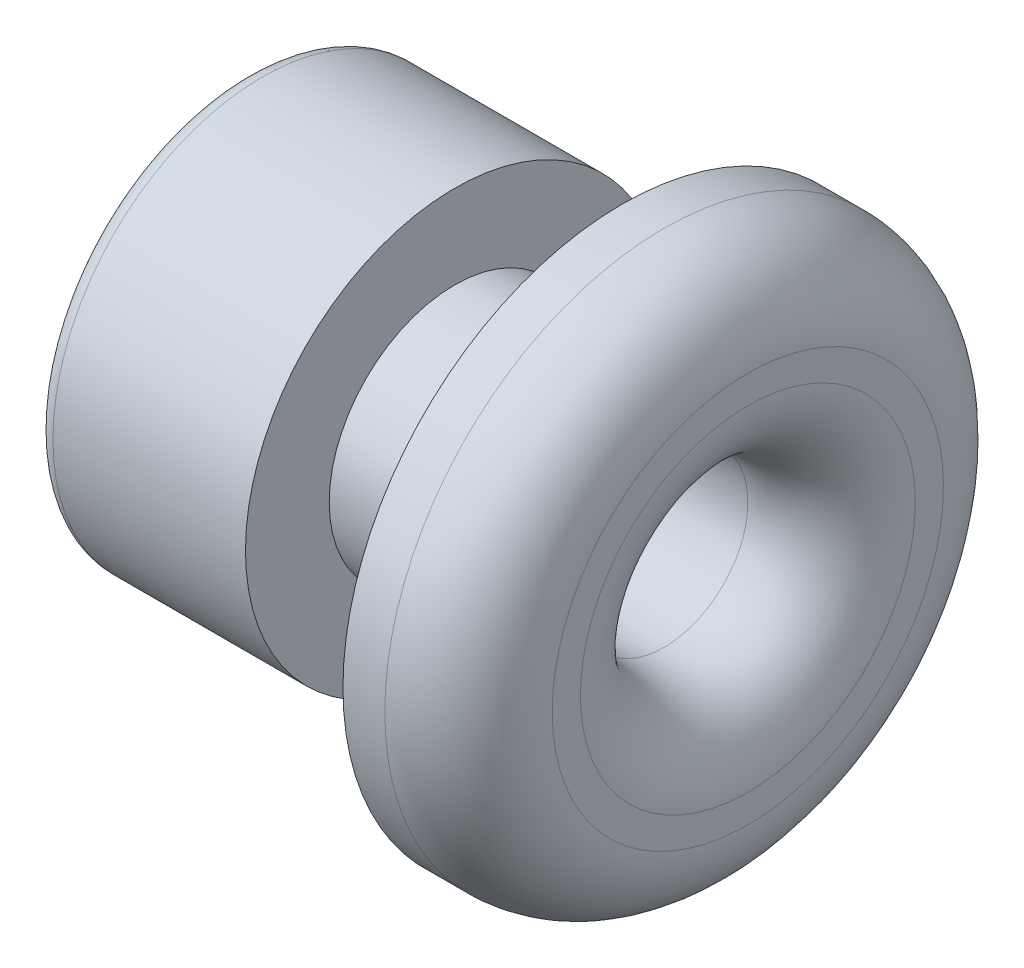
ISO-10303-21;
HEADER;
FILE_DESCRIPTION(('STEP AP214'),'2;1');
FILE_NAME('part.step','',(''),(''),'','','');
FILE_SCHEMA(('AUTOMOTIVE_DESIGN { 1 0 10303 214 1 1 1 1 }'));
ENDSEC;
DATA;
#1=APPLICATION_CONTEXT('core data for automotive mechanical design processes');
#2=APPLICATION_PROTOCOL_DEFINITION('international standard','automotive_design',2000,#1);
#3=PRODUCT_CONTEXT('',#1,'mechanical');
#4=PRODUCT('Part','Part','',(#3));
#5=PRODUCT_RELATED_PRODUCT_CATEGORY('part','',(#4));
#6=PRODUCT_DEFINITION_FORMATION('','',#4);
#7=PRODUCT_DEFINITION_CONTEXT('part definition',#1,'design');
#8=PRODUCT_DEFINITION('design','',#6,#7);
#9=PRODUCT_DEFINITION_SHAPE('','',#8);
#10=(LENGTH_UNIT() NAMED_UNIT(*) SI_UNIT(.MILLI.,.METRE.));
#11=(NAMED_UNIT(*) PLANE_ANGLE_UNIT() SI_UNIT($,.RADIAN.));
#12=(NAMED_UNIT(*) SI_UNIT($,.STERADIAN.) SOLID_ANGLE_UNIT());
#13=UNCERTAINTY_MEASURE_WITH_UNIT(LENGTH_MEASURE(1.E-05),#10,'distance_accuracy_value','');
#14=(GEOMETRIC_REPRESENTATION_CONTEXT(3) GLOBAL_UNCERTAINTY_ASSIGNED_CONTEXT((#13)) GLOBAL_UNIT_ASSIGNED_CONTEXT((#10,
#11,#12)) REPRESENTATION_CONTEXT('',''));
#15=CARTESIAN_POINT('',(0.,0.,0.));
#16=DIRECTION('',(0.,0.,1.));
#17=DIRECTION('',(1.,0.,0.));
#18=AXIS2_PLACEMENT_3D('',#15,#16,#17);
#19=CARTESIAN_POINT('',(0.,0.,0.));
#20=DIRECTION('',(-1.,0.,0.));
#21=DIRECTION('',(0.,0.,1.));
#22=AXIS2_PLACEMENT_3D('',#19,#20,#21);
#23=CYLINDRICAL_SURFACE('',#22,3.3359852338276);
#24=CARTESIAN_POINT('',(0.0562441814122448,0.,0.));
#25=DIRECTION('',(-1.,0.,0.));
#26=DIRECTION('',(0.,0.,1.));
#27=AXIS2_PLACEMENT_3D('',#24,#25,#26);
#28=CIRCLE('',#27,3.3359852338276);
#29=CARTESIAN_POINT('',(0.0562441814122448,0.,3.3359852338276));
#30=VERTEX_POINT('',#29);
#31=EDGE_CURVE('E10',#30,#30,#28,.T.);
#32=ORIENTED_EDGE('',*,*,#31,.F.);
#33=EDGE_LOOP('',(#32));
#34=FACE_BOUND('',#33,.T.);
#35=CARTESIAN_POINT('',(0.556244181412245,0.,0.));
#36=DIRECTION('',(-1.,0.,0.));
#37=DIRECTION('',(0.,0.,1.));
#38=AXIS2_PLACEMENT_3D('',#35,#36,#37);
#39=CIRCLE('',#38,3.3359852338276);
#40=CARTESIAN_POINT('',(0.556244181412245,0.,3.3359852338276));
#41=VERTEX_POINT('',#40);
#42=EDGE_CURVE('E61',#41,#41,#39,.T.);
#43=ORIENTED_EDGE('',*,*,#42,.T.);
#44=EDGE_LOOP('',(#43));
#45=FACE_BOUND('',#44,.T.);
#46=ADVANCED_FACE('F15',(#34,#45),#23,.T.);
#47=CARTESIAN_POINT('',(0.0562441814122448,3.3359852338276,0.));
#48=DIRECTION('',(1.,0.,0.));
#49=DIRECTION('',(0.,0.,-1.));
#50=AXIS2_PLACEMENT_3D('',#47,#48,#49);
#51=PLANE('',#50);
#52=CARTESIAN_POINT('',(0.0562441814122453,0.,0.));
#53=DIRECTION('',(-1.,0.,0.));
#54=DIRECTION('',(0.,0.,1.));
#55=AXIS2_PLACEMENT_3D('',#52,#53,#54);
#56=CIRCLE('',#55,1.5);
#57=CARTESIAN_POINT('',(0.0562441814122453,0.,1.5));
#58=VERTEX_POINT('',#57);
#59=EDGE_CURVE('E21',#58,#58,#56,.T.);
#60=ORIENTED_EDGE('',*,*,#59,.F.);
#61=EDGE_LOOP('',(#60));
#62=FACE_BOUND('',#61,.T.);
#63=ORIENTED_EDGE('',*,*,#31,.T.);
#64=EDGE_LOOP('',(#63));
#65=FACE_BOUND('',#64,.T.);
#66=ADVANCED_FACE('F134',(#62,#65),#51,.F.);
#67=CARTESIAN_POINT('',(0.,0.,0.));
#68=DIRECTION('',(-1.,0.,0.));
#69=DIRECTION('',(0.,0.,1.));
#70=AXIS2_PLACEMENT_3D('',#67,#68,#69);
#71=CYLINDRICAL_SURFACE('',#70,1.5);
#72=CARTESIAN_POINT('',(-1.94375581858776,0.,0.));
#73=DIRECTION('',(-1.,0.,0.));
#74=DIRECTION('',(0.,0.,1.));
#75=AXIS2_PLACEMENT_3D('',#72,#73,#74);
#76=CIRCLE('',#75,1.5);
#77=CARTESIAN_POINT('',(-1.94375581858776,0.,1.5));
#78=VERTEX_POINT('',#77);
#79=EDGE_CURVE('E25',#78,#78,#76,.T.);
#80=ORIENTED_EDGE('',*,*,#79,.F.);
#81=EDGE_LOOP('',(#80));
#82=FACE_BOUND('',#81,.T.);
#83=ORIENTED_EDGE('',*,*,#59,.T.);
#84=EDGE_LOOP('',(#83));
#85=FACE_BOUND('',#84,.T.);
#86=ADVANCED_FACE('F129',(#82,#85),#71,.T.);
#87=CARTESIAN_POINT('',(-1.94375581858776,1.5,0.));
#88=DIRECTION('',(-1.,0.,0.));
#89=DIRECTION('',(0.,0.,1.));
#90=AXIS2_PLACEMENT_3D('',#87,#88,#89);
#91=PLANE('',#90);
#92=CARTESIAN_POINT('',(-1.94375581858776,0.,0.));
#93=DIRECTION('',(-1.,0.,0.));
#94=DIRECTION('',(0.,0.,1.));
#95=AXIS2_PLACEMENT_3D('',#92,#93,#94);
#96=CIRCLE('',#95,2.5);
#97=CARTESIAN_POINT('',(-1.94375581858776,0.,2.5));
#98=VERTEX_POINT('',#97);
#99=EDGE_CURVE('E29',#98,#98,#96,.T.);
#100=ORIENTED_EDGE('',*,*,#99,.F.);
#101=EDGE_LOOP('',(#100));
#102=FACE_BOUND('',#101,.T.);
#103=ORIENTED_EDGE('',*,*,#79,.T.);
#104=EDGE_LOOP('',(#103));
#105=FACE_BOUND('',#104,.T.);
#106=ADVANCED_FACE('F123',(#102,#105),#91,.F.);
#107=CARTESIAN_POINT('',(0.,0.,0.));
#108=DIRECTION('',(-1.,0.,0.));
#109=DIRECTION('',(0.,0.,1.));
#110=AXIS2_PLACEMENT_3D('',#107,#108,#109);
#111=CYLINDRICAL_SURFACE('',#110,2.5);
#112=CARTESIAN_POINT('',(-4.24375581858776,0.,0.));
#113=DIRECTION('',(-1.,0.,0.));
#114=DIRECTION('',(0.,0.,1.));
#115=AXIS2_PLACEMENT_3D('',#112,#113,#114);
#116=CIRCLE('',#115,2.5);
#117=CARTESIAN_POINT('',(-4.24375581858776,0.,2.5));
#118=VERTEX_POINT('',#117);
#119=EDGE_CURVE('E34',#118,#118,#116,.T.);
#120=ORIENTED_EDGE('',*,*,#119,.F.);
#121=EDGE_LOOP('',(#120));
#122=FACE_BOUND('',#121,.T.);
#123=ORIENTED_EDGE('',*,*,#99,.T.);
#124=EDGE_LOOP('',(#123));
#125=FACE_BOUND('',#124,.T.);
#126=ADVANCED_FACE('F117',(#122,#125),#111,.T.);
#127=CARTESIAN_POINT('',(-4.24375581858776,0.,0.));
#128=DIRECTION('',(-1.,0.,0.));
#129=DIRECTION('',(0.,0.,1.));
#130=AXIS2_PLACEMENT_3D('',#127,#128,#129);
#131=TOROIDAL_SURFACE('',#130,2.3,0.2);
#132=CARTESIAN_POINT('',(-4.44375581858775,0.,0.));
#133=DIRECTION('',(-1.,0.,0.));
#134=DIRECTION('',(0.,0.,1.));
#135=AXIS2_PLACEMENT_3D('',#132,#133,#134);
#136=CIRCLE('',#135,2.3);
#137=CARTESIAN_POINT('',(-4.44375581858775,0.,2.3));
#138=VERTEX_POINT('',#137);
#139=EDGE_CURVE('E37',#138,#138,#136,.T.);
#140=ORIENTED_EDGE('',*,*,#139,.F.);
#141=EDGE_LOOP('',(#140));
#142=FACE_BOUND('',#141,.T.);
#143=ORIENTED_EDGE('',*,*,#119,.T.);
#144=EDGE_LOOP('',(#143));
#145=FACE_BOUND('',#144,.T.);
#146=ADVANCED_FACE('F111',(#142,#145),#131,.T.);
#147=CARTESIAN_POINT('',(-4.44375581858775,2.2,0.));
#148=DIRECTION('',(1.,0.,0.));
#149=DIRECTION('',(0.,0.,-1.));
#150=AXIS2_PLACEMENT_3D('',#147,#148,#149);
#151=PLANE('',#150);
#152=CARTESIAN_POINT('',(-4.44375581858775,0.,0.));
#153=DIRECTION('',(-1.,0.,0.));
#154=DIRECTION('',(0.,0.,1.));
#155=AXIS2_PLACEMENT_3D('',#152,#153,#154);
#156=CIRCLE('',#155,2.2);
#157=CARTESIAN_POINT('',(-4.44375581858775,0.,2.2));
#158=VERTEX_POINT('',#157);
#159=EDGE_CURVE('E40',#158,#158,#156,.T.);
#160=ORIENTED_EDGE('',*,*,#159,.F.);
#161=EDGE_LOOP('',(#160));
#162=FACE_BOUND('',#161,.T.);
#163=ORIENTED_EDGE('',*,*,#139,.T.);
#164=EDGE_LOOP('',(#163));
#165=FACE_BOUND('',#164,.T.);
#166=ADVANCED_FACE('F105',(#162,#165),#151,.F.);
#167=CARTESIAN_POINT('',(-4.24375581858776,0.,0.));
#168=DIRECTION('',(-1.,0.,0.));
#169=DIRECTION('',(0.,0.,1.));
#170=AXIS2_PLACEMENT_3D('',#167,#168,#169);
#171=TOROIDAL_SURFACE('',#170,2.2,0.2);
#172=CARTESIAN_POINT('',(-4.24375581858776,0.,0.));
#173=DIRECTION('',(-1.,0.,0.));
#174=DIRECTION('',(0.,0.,1.));
#175=AXIS2_PLACEMENT_3D('',#172,#173,#174);
#176=CIRCLE('',#175,2.);
#177=CARTESIAN_POINT('',(-4.24375581858776,0.,2.));
#178=VERTEX_POINT('',#177);
#179=EDGE_CURVE('E43',#178,#178,#176,.T.);
#180=ORIENTED_EDGE('',*,*,#179,.F.);
#181=EDGE_LOOP('',(#180));
#182=FACE_BOUND('',#181,.T.);
#183=ORIENTED_EDGE('',*,*,#159,.T.);
#184=EDGE_LOOP('',(#183));
#185=FACE_BOUND('',#184,.T.);
#186=ADVANCED_FACE('F99',(#182,#185),#171,.T.);
#187=CARTESIAN_POINT('',(0.,0.,0.));
#188=DIRECTION('',(-1.,0.,0.));
#189=DIRECTION('',(0.,0.,1.));
#190=AXIS2_PLACEMENT_3D('',#187,#188,#189);
#191=CYLINDRICAL_SURFACE('',#190,2.);
#192=CARTESIAN_POINT('',(-2.44375581858775,0.,0.));
#193=DIRECTION('',(-1.,0.,0.));
#194=DIRECTION('',(0.,0.,1.));
#195=AXIS2_PLACEMENT_3D('',#192,#193,#194);
#196=CIRCLE('',#195,2.);
#197=CARTESIAN_POINT('',(-2.44375581858775,0.,2.));
#198=VERTEX_POINT('',#197);
#199=EDGE_CURVE('E46',#198,#198,#196,.T.);
#200=ORIENTED_EDGE('',*,*,#199,.F.);
#201=EDGE_LOOP('',(#200));
#202=FACE_BOUND('',#201,.T.);
#203=ORIENTED_EDGE('',*,*,#179,.T.);
#204=EDGE_LOOP('',(#203));
#205=FACE_BOUND('',#204,.T.);
#206=ADVANCED_FACE('F93',(#202,#205),#191,.F.);
#207=CARTESIAN_POINT('',(-2.44375581858775,1.,0.));
#208=DIRECTION('',(1.,0.,0.));
#209=DIRECTION('',(0.,0.,-1.));
#210=AXIS2_PLACEMENT_3D('',#207,#208,#209);
#211=PLANE('',#210);
#212=CARTESIAN_POINT('',(-2.44375581858775,0.,0.));
#213=DIRECTION('',(-1.,0.,0.));
#214=DIRECTION('',(0.,0.,1.));
#215=AXIS2_PLACEMENT_3D('',#212,#213,#214);
#216=CIRCLE('',#215,1.);
#217=CARTESIAN_POINT('',(-2.44375581858775,0.,1.));
#218=VERTEX_POINT('',#217);
#219=EDGE_CURVE('E49',#218,#218,#216,.T.);
#220=ORIENTED_EDGE('',*,*,#219,.F.);
#221=EDGE_LOOP('',(#220));
#222=FACE_BOUND('',#221,.T.);
#223=ORIENTED_EDGE('',*,*,#199,.T.);
#224=EDGE_LOOP('',(#223));
#225=FACE_BOUND('',#224,.T.);
#226=ADVANCED_FACE('F87',(#222,#225),#211,.F.);
#227=CARTESIAN_POINT('',(0.,0.,0.));
#228=DIRECTION('',(-1.,0.,0.));
#229=DIRECTION('',(0.,0.,1.));
#230=AXIS2_PLACEMENT_3D('',#227,#228,#229);
#231=CYLINDRICAL_SURFACE('',#230,1.);
#232=CARTESIAN_POINT('',(0.556244181412245,0.,0.));
#233=DIRECTION('',(-1.,0.,0.));
#234=DIRECTION('',(0.,0.,1.));
#235=AXIS2_PLACEMENT_3D('',#232,#233,#234);
#236=CIRCLE('',#235,1.);
#237=CARTESIAN_POINT('',(0.556244181412245,0.,1.));
#238=VERTEX_POINT('',#237);
#239=EDGE_CURVE('E52',#238,#238,#236,.T.);
#240=ORIENTED_EDGE('',*,*,#239,.F.);
#241=EDGE_LOOP('',(#240));
#242=FACE_BOUND('',#241,.T.);
#243=ORIENTED_EDGE('',*,*,#219,.T.);
#244=EDGE_LOOP('',(#243));
#245=FACE_BOUND('',#244,.T.);
#246=ADVANCED_FACE('F81',(#242,#245),#231,.F.);
#247=CARTESIAN_POINT('',(0.556244181412245,0.,0.));
#248=DIRECTION('',(-1.,0.,0.));
#249=DIRECTION('',(0.,0.,1.));
#250=AXIS2_PLACEMENT_3D('',#247,#248,#249);
#251=TOROIDAL_SURFACE('',#250,2.,1.);
#252=CARTESIAN_POINT('',(1.55624418141224,0.,0.));
#253=DIRECTION('',(-1.,0.,0.));
#254=DIRECTION('',(0.,0.,1.));
#255=AXIS2_PLACEMENT_3D('',#252,#253,#254);
#256=CIRCLE('',#255,2.);
#257=CARTESIAN_POINT('',(1.55624418141224,0.,2.));
#258=VERTEX_POINT('',#257);
#259=EDGE_CURVE('E55',#258,#258,#256,.T.);
#260=ORIENTED_EDGE('',*,*,#259,.F.);
#261=EDGE_LOOP('',(#260));
#262=FACE_BOUND('',#261,.T.);
#263=ORIENTED_EDGE('',*,*,#239,.T.);
#264=EDGE_LOOP('',(#263));
#265=FACE_BOUND('',#264,.T.);
#266=ADVANCED_FACE('F75',(#262,#265),#251,.T.);
#267=CARTESIAN_POINT('',(1.55624418141224,2.3359852338276,0.));
#268=DIRECTION('',(-1.,0.,0.));
#269=DIRECTION('',(0.,0.,1.));
#270=AXIS2_PLACEMENT_3D('',#267,#268,#269);
#271=PLANE('',#270);
#272=CARTESIAN_POINT('',(1.55624418141224,0.,0.));
#273=DIRECTION('',(-1.,0.,0.));
#274=DIRECTION('',(0.,0.,1.));
#275=AXIS2_PLACEMENT_3D('',#272,#273,#274);
#276=CIRCLE('',#275,2.3359852338276);
#277=CARTESIAN_POINT('',(1.55624418141224,0.,2.3359852338276));
#278=VERTEX_POINT('',#277);
#279=EDGE_CURVE('E58',#278,#278,#276,.T.);
#280=ORIENTED_EDGE('',*,*,#279,.F.);
#281=EDGE_LOOP('',(#280));
#282=FACE_BOUND('',#281,.T.);
#283=ORIENTED_EDGE('',*,*,#259,.T.);
#284=EDGE_LOOP('',(#283));
#285=FACE_BOUND('',#284,.T.);
#286=ADVANCED_FACE('F69',(#282,#285),#271,.F.);
#287=CARTESIAN_POINT('',(0.556244181412245,0.,0.));
#288=DIRECTION('',(-1.,0.,0.));
#289=DIRECTION('',(0.,0.,1.));
#290=AXIS2_PLACEMENT_3D('',#287,#288,#289);
#291=TOROIDAL_SURFACE('',#290,2.3359852338276,1.);
#292=ORIENTED_EDGE('',*,*,#42,.F.);
#293=EDGE_LOOP('',(#292));
#294=FACE_BOUND('',#293,.T.);
#295=ORIENTED_EDGE('',*,*,#279,.T.);
#296=EDGE_LOOP('',(#295));
#297=FACE_BOUND('',#296,.T.);
#298=ADVANCED_FACE('F66',(#294,#297),#291,.T.);
#299=CLOSED_SHELL('',(#46,#66,#86,#106,#126,#146,#166,#186,#206,#226,#246,#266,#286,#298));
#300=MANIFOLD_SOLID_BREP('B1',#299);
#301=ADVANCED_BREP_SHAPE_REPRESENTATION('',(#18,#300),#14);
#302=SHAPE_DEFINITION_REPRESENTATION(#9,#301);
ENDSEC;
END-ISO-10303-21;
